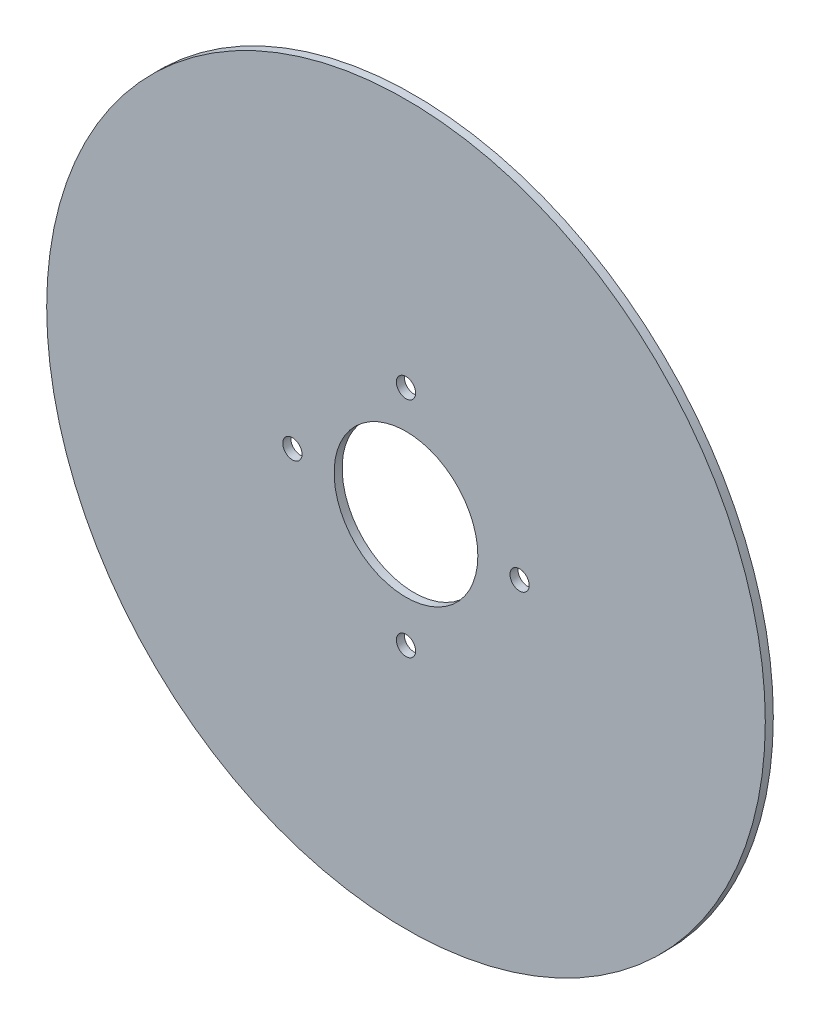
ISO-10303-21;
HEADER;
FILE_DESCRIPTION(('STEP AP214'),'2;1');
FILE_NAME('part.step','',(''),(''),'','','');
FILE_SCHEMA(('AUTOMOTIVE_DESIGN { 1 0 10303 214 1 1 1 1 }'));
ENDSEC;
DATA;
#1=APPLICATION_CONTEXT('core data for automotive mechanical design processes');
#2=APPLICATION_PROTOCOL_DEFINITION('international standard','automotive_design',2000,#1);
#3=PRODUCT_CONTEXT('',#1,'mechanical');
#4=PRODUCT('Part','Part','',(#3));
#5=PRODUCT_RELATED_PRODUCT_CATEGORY('part','',(#4));
#6=PRODUCT_DEFINITION_FORMATION('','',#4);
#7=PRODUCT_DEFINITION_CONTEXT('part definition',#1,'design');
#8=PRODUCT_DEFINITION('design','',#6,#7);
#9=PRODUCT_DEFINITION_SHAPE('','',#8);
#10=(LENGTH_UNIT() NAMED_UNIT(*) SI_UNIT(.MILLI.,.METRE.));
#11=(NAMED_UNIT(*) PLANE_ANGLE_UNIT() SI_UNIT($,.RADIAN.));
#12=(NAMED_UNIT(*) SI_UNIT($,.STERADIAN.) SOLID_ANGLE_UNIT());
#13=UNCERTAINTY_MEASURE_WITH_UNIT(LENGTH_MEASURE(1.E-05),#10,'distance_accuracy_value','');
#14=(GEOMETRIC_REPRESENTATION_CONTEXT(3) GLOBAL_UNCERTAINTY_ASSIGNED_CONTEXT((#13)) GLOBAL_UNIT_ASSIGNED_CONTEXT((#10,
#11,#12)) REPRESENTATION_CONTEXT('',''));
#15=CARTESIAN_POINT('',(0.,0.,0.));
#16=DIRECTION('',(0.,0.,1.));
#17=DIRECTION('',(1.,0.,0.));
#18=AXIS2_PLACEMENT_3D('',#15,#16,#17);
#19=CARTESIAN_POINT('',(0.,0.,1.25));
#20=DIRECTION('',(0.,0.,1.));
#21=DIRECTION('',(1.,0.,0.));
#22=AXIS2_PLACEMENT_3D('',#19,#20,#21);
#23=PLANE('',#22);
#24=CARTESIAN_POINT('',(0.,17.1,1.25));
#25=DIRECTION('',(0.,0.,1.));
#26=DIRECTION('',(1.,0.,0.));
#27=AXIS2_PLACEMENT_3D('',#24,#25,#26);
#28=CIRCLE('',#27,1.5);
#29=CARTESIAN_POINT('',(1.5,17.1,1.25));
#30=VERTEX_POINT('',#29);
#31=EDGE_CURVE('E70',#30,#30,#28,.T.);
#32=ORIENTED_EDGE('',*,*,#31,.F.);
#33=EDGE_LOOP('',(#32));
#34=FACE_BOUND('',#33,.T.);
#35=CARTESIAN_POINT('',(-17.7,0.,1.25));
#36=DIRECTION('',(0.,0.,1.));
#37=DIRECTION('',(1.,0.,0.));
#38=AXIS2_PLACEMENT_3D('',#35,#36,#37);
#39=CIRCLE('',#38,1.5);
#40=CARTESIAN_POINT('',(-16.2,0.,1.25));
#41=VERTEX_POINT('',#40);
#42=EDGE_CURVE('E64',#41,#41,#39,.T.);
#43=ORIENTED_EDGE('',*,*,#42,.F.);
#44=EDGE_LOOP('',(#43));
#45=FACE_BOUND('',#44,.T.);
#46=CARTESIAN_POINT('',(0.,-17.7,1.25));
#47=DIRECTION('',(0.,0.,1.));
#48=DIRECTION('',(1.,0.,0.));
#49=AXIS2_PLACEMENT_3D('',#46,#47,#48);
#50=CIRCLE('',#49,1.5);
#51=CARTESIAN_POINT('',(1.5,-17.7,1.25));
#52=VERTEX_POINT('',#51);
#53=EDGE_CURVE('E58',#52,#52,#50,.T.);
#54=ORIENTED_EDGE('',*,*,#53,.F.);
#55=EDGE_LOOP('',(#54));
#56=FACE_BOUND('',#55,.T.);
#57=CARTESIAN_POINT('',(17.7,0.,1.25));
#58=DIRECTION('',(0.,0.,1.));
#59=DIRECTION('',(1.,0.,0.));
#60=AXIS2_PLACEMENT_3D('',#57,#58,#59);
#61=CIRCLE('',#60,1.5);
#62=CARTESIAN_POINT('',(19.2,0.,1.25));
#63=VERTEX_POINT('',#62);
#64=EDGE_CURVE('E52',#63,#63,#61,.T.);
#65=ORIENTED_EDGE('',*,*,#64,.F.);
#66=EDGE_LOOP('',(#65));
#67=FACE_BOUND('',#66,.T.);
#68=CARTESIAN_POINT('',(0.,0.,1.25));
#69=DIRECTION('',(0.,0.,1.));
#70=DIRECTION('',(1.,0.,0.));
#71=AXIS2_PLACEMENT_3D('',#68,#69,#70);
#72=CIRCLE('',#71,56.);
#73=CARTESIAN_POINT('',(56.,0.,1.25));
#74=VERTEX_POINT('',#73);
#75=EDGE_CURVE('E10',#74,#74,#72,.T.);
#76=ORIENTED_EDGE('',*,*,#75,.T.);
#77=EDGE_LOOP('',(#76));
#78=FACE_BOUND('',#77,.T.);
#79=CARTESIAN_POINT('',(0.,0.,1.25));
#80=DIRECTION('',(0.,0.,1.));
#81=DIRECTION('',(1.,0.,0.));
#82=AXIS2_PLACEMENT_3D('',#79,#80,#81);
#83=CIRCLE('',#82,11.2);
#84=CARTESIAN_POINT('',(11.2,0.,1.25));
#85=VERTEX_POINT('',#84);
#86=EDGE_CURVE('E42',#85,#85,#83,.T.);
#87=ORIENTED_EDGE('',*,*,#86,.F.);
#88=EDGE_LOOP('',(#87));
#89=FACE_BOUND('',#88,.T.);
#90=ADVANCED_FACE('F31',(#34,#45,#56,#67,#78,#89),#23,.T.);
#91=CARTESIAN_POINT('',(0.,0.,0.));
#92=DIRECTION('',(0.,0.,1.));
#93=DIRECTION('',(1.,0.,0.));
#94=AXIS2_PLACEMENT_3D('',#91,#92,#93);
#95=PLANE('',#94);
#96=CARTESIAN_POINT('',(0.,17.1,0.));
#97=DIRECTION('',(0.,0.,1.));
#98=DIRECTION('',(1.,0.,0.));
#99=AXIS2_PLACEMENT_3D('',#96,#97,#98);
#100=CIRCLE('',#99,1.5);
#101=CARTESIAN_POINT('',(1.5,17.1,0.));
#102=VERTEX_POINT('',#101);
#103=EDGE_CURVE('E67',#102,#102,#100,.F.);
#104=ORIENTED_EDGE('',*,*,#103,.F.);
#105=EDGE_LOOP('',(#104));
#106=FACE_BOUND('',#105,.T.);
#107=CARTESIAN_POINT('',(-17.7,0.,0.));
#108=DIRECTION('',(0.,0.,1.));
#109=DIRECTION('',(1.,0.,0.));
#110=AXIS2_PLACEMENT_3D('',#107,#108,#109);
#111=CIRCLE('',#110,1.5);
#112=CARTESIAN_POINT('',(-16.2,0.,0.));
#113=VERTEX_POINT('',#112);
#114=EDGE_CURVE('E61',#113,#113,#111,.F.);
#115=ORIENTED_EDGE('',*,*,#114,.F.);
#116=EDGE_LOOP('',(#115));
#117=FACE_BOUND('',#116,.T.);
#118=CARTESIAN_POINT('',(0.,-17.7,0.));
#119=DIRECTION('',(0.,0.,1.));
#120=DIRECTION('',(1.,0.,0.));
#121=AXIS2_PLACEMENT_3D('',#118,#119,#120);
#122=CIRCLE('',#121,1.5);
#123=CARTESIAN_POINT('',(1.5,-17.7,0.));
#124=VERTEX_POINT('',#123);
#125=EDGE_CURVE('E55',#124,#124,#122,.F.);
#126=ORIENTED_EDGE('',*,*,#125,.F.);
#127=EDGE_LOOP('',(#126));
#128=FACE_BOUND('',#127,.T.);
#129=CARTESIAN_POINT('',(17.7,0.,0.));
#130=DIRECTION('',(0.,0.,1.));
#131=DIRECTION('',(1.,0.,0.));
#132=AXIS2_PLACEMENT_3D('',#129,#130,#131);
#133=CIRCLE('',#132,1.5);
#134=CARTESIAN_POINT('',(19.2,0.,0.));
#135=VERTEX_POINT('',#134);
#136=EDGE_CURVE('E47',#135,#135,#133,.F.);
#137=ORIENTED_EDGE('',*,*,#136,.F.);
#138=EDGE_LOOP('',(#137));
#139=FACE_BOUND('',#138,.T.);
#140=CARTESIAN_POINT('',(0.,0.,0.));
#141=DIRECTION('',(0.,0.,1.));
#142=DIRECTION('',(1.,0.,0.));
#143=AXIS2_PLACEMENT_3D('',#140,#141,#142);
#144=CIRCLE('',#143,56.);
#145=CARTESIAN_POINT('',(56.,0.,0.));
#146=VERTEX_POINT('',#145);
#147=EDGE_CURVE('E35',#146,#146,#144,.T.);
#148=ORIENTED_EDGE('',*,*,#147,.F.);
#149=EDGE_LOOP('',(#148));
#150=FACE_BOUND('',#149,.T.);
#151=CARTESIAN_POINT('',(0.,0.,0.));
#152=DIRECTION('',(0.,0.,1.));
#153=DIRECTION('',(1.,0.,0.));
#154=AXIS2_PLACEMENT_3D('',#151,#152,#153);
#155=CIRCLE('',#154,11.2);
#156=CARTESIAN_POINT('',(11.2,0.,0.));
#157=VERTEX_POINT('',#156);
#158=EDGE_CURVE('E44',#157,#157,#155,.T.);
#159=ORIENTED_EDGE('',*,*,#158,.T.);
#160=EDGE_LOOP('',(#159));
#161=FACE_BOUND('',#160,.T.);
#162=ADVANCED_FACE('F78',(#106,#117,#128,#139,#150,#161),#95,.F.);
#163=CARTESIAN_POINT('',(0.,0.,1.25));
#164=DIRECTION('',(0.,0.,-1.));
#165=DIRECTION('',(-1.,0.,0.));
#166=AXIS2_PLACEMENT_3D('',#163,#164,#165);
#167=CYLINDRICAL_SURFACE('',#166,56.);
#168=ORIENTED_EDGE('',*,*,#75,.F.);
#169=EDGE_LOOP('',(#168));
#170=FACE_BOUND('',#169,.T.);
#171=ORIENTED_EDGE('',*,*,#147,.T.);
#172=EDGE_LOOP('',(#171));
#173=FACE_BOUND('',#172,.T.);
#174=ADVANCED_FACE('F33',(#170,#173),#167,.T.);
#175=CARTESIAN_POINT('',(0.,0.,1.25));
#176=DIRECTION('',(0.,0.,-1.));
#177=DIRECTION('',(-1.,0.,0.));
#178=AXIS2_PLACEMENT_3D('',#175,#176,#177);
#179=CYLINDRICAL_SURFACE('',#178,11.2);
#180=ORIENTED_EDGE('',*,*,#86,.T.);
#181=EDGE_LOOP('',(#180));
#182=FACE_BOUND('',#181,.T.);
#183=ORIENTED_EDGE('',*,*,#158,.F.);
#184=EDGE_LOOP('',(#183));
#185=FACE_BOUND('',#184,.T.);
#186=ADVANCED_FACE('F88',(#182,#185),#179,.F.);
#187=CARTESIAN_POINT('',(17.7,0.,-4.24264068711929));
#188=DIRECTION('',(0.,0.,1.));
#189=DIRECTION('',(1.,0.,0.));
#190=AXIS2_PLACEMENT_3D('',#187,#188,#189);
#191=CYLINDRICAL_SURFACE('',#190,1.5);
#192=ORIENTED_EDGE('',*,*,#136,.T.);
#193=EDGE_LOOP('',(#192));
#194=FACE_BOUND('',#193,.T.);
#195=ORIENTED_EDGE('',*,*,#64,.T.);
#196=EDGE_LOOP('',(#195));
#197=FACE_BOUND('',#196,.T.);
#198=ADVANCED_FACE('F91',(#194,#197),#191,.F.);
#199=CARTESIAN_POINT('',(0.,-17.7,-4.24264068711929));
#200=DIRECTION('',(0.,0.,1.));
#201=DIRECTION('',(1.,0.,0.));
#202=AXIS2_PLACEMENT_3D('',#199,#200,#201);
#203=CYLINDRICAL_SURFACE('',#202,1.5);
#204=ORIENTED_EDGE('',*,*,#125,.T.);
#205=EDGE_LOOP('',(#204));
#206=FACE_BOUND('',#205,.T.);
#207=ORIENTED_EDGE('',*,*,#53,.T.);
#208=EDGE_LOOP('',(#207));
#209=FACE_BOUND('',#208,.T.);
#210=ADVANCED_FACE('F106',(#206,#209),#203,.F.);
#211=CARTESIAN_POINT('',(-17.7,0.,-4.24264068711929));
#212=DIRECTION('',(0.,0.,1.));
#213=DIRECTION('',(1.,0.,0.));
#214=AXIS2_PLACEMENT_3D('',#211,#212,#213);
#215=CYLINDRICAL_SURFACE('',#214,1.5);
#216=ORIENTED_EDGE('',*,*,#114,.T.);
#217=EDGE_LOOP('',(#216));
#218=FACE_BOUND('',#217,.T.);
#219=ORIENTED_EDGE('',*,*,#42,.T.);
#220=EDGE_LOOP('',(#219));
#221=FACE_BOUND('',#220,.T.);
#222=ADVANCED_FACE('F110',(#218,#221),#215,.F.);
#223=CARTESIAN_POINT('',(0.,17.1,-4.24264068711929));
#224=DIRECTION('',(0.,0.,1.));
#225=DIRECTION('',(1.,0.,0.));
#226=AXIS2_PLACEMENT_3D('',#223,#224,#225);
#227=CYLINDRICAL_SURFACE('',#226,1.5);
#228=ORIENTED_EDGE('',*,*,#103,.T.);
#229=EDGE_LOOP('',(#228));
#230=FACE_BOUND('',#229,.T.);
#231=ORIENTED_EDGE('',*,*,#31,.T.);
#232=EDGE_LOOP('',(#231));
#233=FACE_BOUND('',#232,.T.);
#234=ADVANCED_FACE('F74',(#230,#233),#227,.F.);
#235=CLOSED_SHELL('',(#90,#162,#174,#186,#198,#210,#222,#234));
#236=MANIFOLD_SOLID_BREP('B2',#235);
#237=ADVANCED_BREP_SHAPE_REPRESENTATION('',(#18,#236),#14);
#238=SHAPE_DEFINITION_REPRESENTATION(#9,#237);
ENDSEC;
END-ISO-10303-21;
